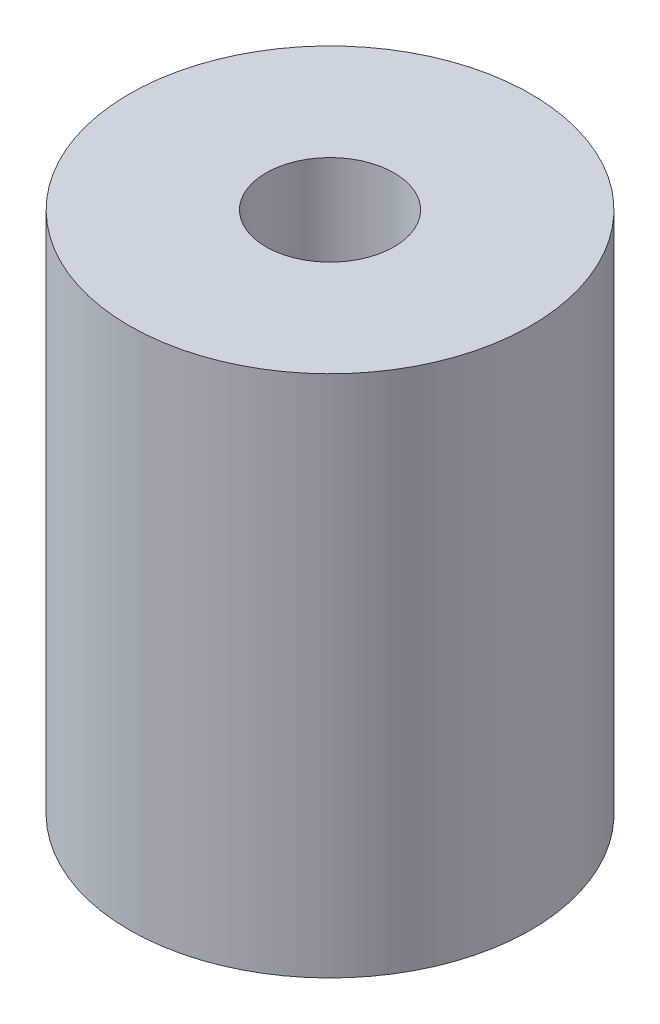
ISO-10303-21;
HEADER;
FILE_DESCRIPTION(('STEP AP214'),'2;1');
FILE_NAME('part.step','',(''),(''),'','','');
FILE_SCHEMA(('AUTOMOTIVE_DESIGN { 1 0 10303 214 1 1 1 1 }'));
ENDSEC;
DATA;
#1=APPLICATION_CONTEXT('core data for automotive mechanical design processes');
#2=APPLICATION_PROTOCOL_DEFINITION('international standard','automotive_design',2000,#1);
#3=PRODUCT_CONTEXT('',#1,'mechanical');
#4=PRODUCT('Part','Part','',(#3));
#5=PRODUCT_RELATED_PRODUCT_CATEGORY('part','',(#4));
#6=PRODUCT_DEFINITION_FORMATION('','',#4);
#7=PRODUCT_DEFINITION_CONTEXT('part definition',#1,'design');
#8=PRODUCT_DEFINITION('design','',#6,#7);
#9=PRODUCT_DEFINITION_SHAPE('','',#8);
#10=(LENGTH_UNIT() NAMED_UNIT(*) SI_UNIT(.MILLI.,.METRE.));
#11=(NAMED_UNIT(*) PLANE_ANGLE_UNIT() SI_UNIT($,.RADIAN.));
#12=(NAMED_UNIT(*) SI_UNIT($,.STERADIAN.) SOLID_ANGLE_UNIT());
#13=UNCERTAINTY_MEASURE_WITH_UNIT(LENGTH_MEASURE(1.E-05),#10,'distance_accuracy_value','');
#14=(GEOMETRIC_REPRESENTATION_CONTEXT(3) GLOBAL_UNCERTAINTY_ASSIGNED_CONTEXT((#13)) GLOBAL_UNIT_ASSIGNED_CONTEXT((#10,
#11,#12)) REPRESENTATION_CONTEXT('',''));
#15=CARTESIAN_POINT('',(0.,0.,0.));
#16=DIRECTION('',(0.,0.,1.));
#17=DIRECTION('',(1.,0.,0.));
#18=AXIS2_PLACEMENT_3D('',#15,#16,#17);
#19=CARTESIAN_POINT('',(0.,24.5,0.));
#20=DIRECTION('',(0.,-1.,0.));
#21=DIRECTION('',(0.,0.,-1.));
#22=AXIS2_PLACEMENT_3D('',#19,#20,#21);
#23=CYLINDRICAL_SURFACE('',#22,9.4);
#24=CARTESIAN_POINT('',(0.,24.5,0.));
#25=DIRECTION('',(0.,1.,0.));
#26=DIRECTION('',(0.,0.,1.));
#27=AXIS2_PLACEMENT_3D('',#24,#25,#26);
#28=CIRCLE('',#27,9.4);
#29=CARTESIAN_POINT('',(0.,24.5,9.4));
#30=VERTEX_POINT('',#29);
#31=EDGE_CURVE('E10',#30,#30,#28,.T.);
#32=ORIENTED_EDGE('',*,*,#31,.F.);
#33=EDGE_LOOP('',(#32));
#34=FACE_BOUND('',#33,.T.);
#35=CARTESIAN_POINT('',(0.,0.,0.));
#36=DIRECTION('',(0.,1.,0.));
#37=DIRECTION('',(0.,0.,1.));
#38=AXIS2_PLACEMENT_3D('',#35,#36,#37);
#39=CIRCLE('',#38,9.4);
#40=CARTESIAN_POINT('',(0.,0.,9.4));
#41=VERTEX_POINT('',#40);
#42=EDGE_CURVE('E42',#41,#41,#39,.T.);
#43=ORIENTED_EDGE('',*,*,#42,.T.);
#44=EDGE_LOOP('',(#43));
#45=FACE_BOUND('',#44,.T.);
#46=ADVANCED_FACE('F39',(#34,#45),#23,.T.);
#47=CARTESIAN_POINT('',(0.,24.5,0.));
#48=DIRECTION('',(0.,1.,0.));
#49=DIRECTION('',(0.,0.,1.));
#50=AXIS2_PLACEMENT_3D('',#47,#48,#49);
#51=PLANE('',#50);
#52=CARTESIAN_POINT('',(0.,24.5,0.));
#53=DIRECTION('',(0.,1.,0.));
#54=DIRECTION('',(0.,0.,1.));
#55=AXIS2_PLACEMENT_3D('',#52,#53,#54);
#56=CIRCLE('',#55,3.);
#57=CARTESIAN_POINT('',(0.,24.5,3.));
#58=VERTEX_POINT('',#57);
#59=EDGE_CURVE('E51',#58,#58,#56,.T.);
#60=ORIENTED_EDGE('',*,*,#59,.F.);
#61=EDGE_LOOP('',(#60));
#62=FACE_BOUND('',#61,.T.);
#63=ORIENTED_EDGE('',*,*,#31,.T.);
#64=EDGE_LOOP('',(#63));
#65=FACE_BOUND('',#64,.T.);
#66=ADVANCED_FACE('F82',(#62,#65),#51,.T.);
#67=CARTESIAN_POINT('',(0.,0.,0.));
#68=DIRECTION('',(0.,1.,0.));
#69=DIRECTION('',(0.,0.,1.));
#70=AXIS2_PLACEMENT_3D('',#67,#68,#69);
#71=PLANE('',#70);
#72=CARTESIAN_POINT('',(0.,0.,0.));
#73=DIRECTION('',(0.,-1.,0.));
#74=DIRECTION('',(0.,0.,-1.));
#75=AXIS2_PLACEMENT_3D('',#72,#73,#74);
#76=CIRCLE('',#75,3.175);
#77=CARTESIAN_POINT('',(0.,0.,-3.175));
#78=VERTEX_POINT('',#77);
#79=EDGE_CURVE('E61',#78,#78,#76,.T.);
#80=ORIENTED_EDGE('',*,*,#79,.F.);
#81=EDGE_LOOP('',(#80));
#82=FACE_BOUND('',#81,.T.);
#83=ORIENTED_EDGE('',*,*,#42,.F.);
#84=EDGE_LOOP('',(#83));
#85=FACE_BOUND('',#84,.T.);
#86=ADVANCED_FACE('F78',(#82,#85),#71,.F.);
#87=CARTESIAN_POINT('',(0.,16.6,0.));
#88=DIRECTION('',(0.,1.,0.));
#89=DIRECTION('',(0.,0.,1.));
#90=AXIS2_PLACEMENT_3D('',#87,#88,#89);
#91=CYLINDRICAL_SURFACE('',#90,3.);
#92=CARTESIAN_POINT('',(0.,16.6,0.));
#93=DIRECTION('',(0.,1.,0.));
#94=DIRECTION('',(0.,0.,1.));
#95=AXIS2_PLACEMENT_3D('',#92,#93,#94);
#96=CIRCLE('',#95,3.);
#97=CARTESIAN_POINT('',(0.,16.6,3.));
#98=VERTEX_POINT('',#97);
#99=EDGE_CURVE('E56',#98,#98,#96,.T.);
#100=ORIENTED_EDGE('',*,*,#99,.F.);
#101=EDGE_LOOP('',(#100));
#102=FACE_BOUND('',#101,.T.);
#103=ORIENTED_EDGE('',*,*,#59,.T.);
#104=EDGE_LOOP('',(#103));
#105=FACE_BOUND('',#104,.T.);
#106=ADVANCED_FACE('F81',(#102,#105),#91,.F.);
#107=CARTESIAN_POINT('',(0.,16.6,0.));
#108=DIRECTION('',(0.,-1.,0.));
#109=DIRECTION('',(0.,0.,-1.));
#110=AXIS2_PLACEMENT_3D('',#107,#108,#109);
#111=PLANE('',#110);
#112=CARTESIAN_POINT('',(0.,16.6,0.));
#113=DIRECTION('',(0.,-1.,0.));
#114=DIRECTION('',(0.,0.,-1.));
#115=AXIS2_PLACEMENT_3D('',#112,#113,#114);
#116=CIRCLE('',#115,3.175);
#117=CARTESIAN_POINT('',(0.,16.6,-3.175));
#118=VERTEX_POINT('',#117);
#119=EDGE_CURVE('E60',#118,#118,#116,.T.);
#120=ORIENTED_EDGE('',*,*,#119,.T.);
#121=EDGE_LOOP('',(#120));
#122=FACE_BOUND('',#121,.T.);
#123=ORIENTED_EDGE('',*,*,#99,.T.);
#124=EDGE_LOOP('',(#123));
#125=FACE_BOUND('',#124,.T.);
#126=ADVANCED_FACE('F69',(#122,#125),#111,.T.);
#127=CARTESIAN_POINT('',(0.,16.6,0.));
#128=DIRECTION('',(0.,-1.,0.));
#129=DIRECTION('',(0.,0.,-1.));
#130=AXIS2_PLACEMENT_3D('',#127,#128,#129);
#131=CYLINDRICAL_SURFACE('',#130,3.175);
#132=ORIENTED_EDGE('',*,*,#119,.F.);
#133=EDGE_LOOP('',(#132));
#134=FACE_BOUND('',#133,.T.);
#135=ORIENTED_EDGE('',*,*,#79,.T.);
#136=EDGE_LOOP('',(#135));
#137=FACE_BOUND('',#136,.T.);
#138=ADVANCED_FACE('F72',(#134,#137),#131,.F.);
#139=CLOSED_SHELL('',(#46,#66,#86,#106,#126,#138));
#140=MANIFOLD_SOLID_BREP('B2',#139);
#141=ADVANCED_BREP_SHAPE_REPRESENTATION('',(#18,#140),#14);
#142=SHAPE_DEFINITION_REPRESENTATION(#9,#141);
ENDSEC;
END-ISO-10303-21;
